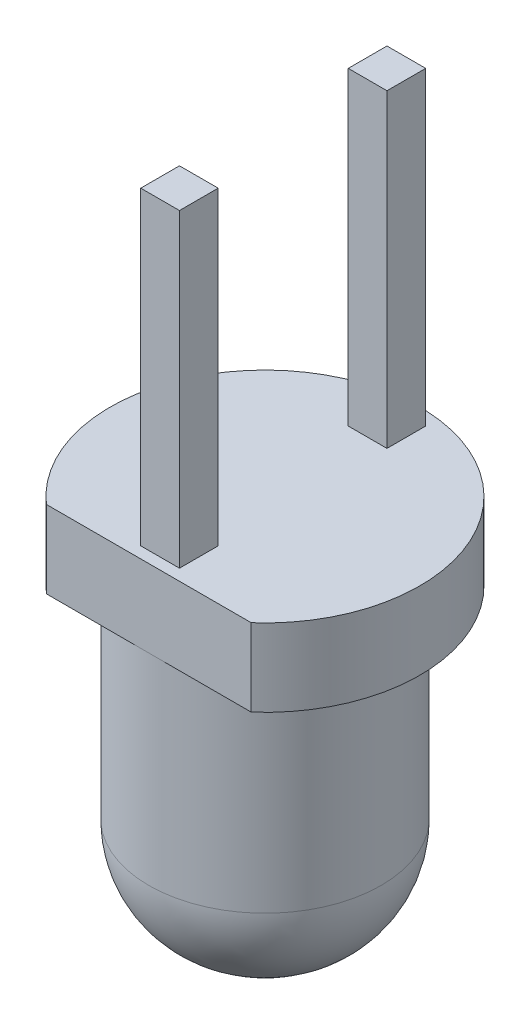
ISO-10303-21;
HEADER;
FILE_DESCRIPTION(('STEP AP214'),'2;1');
FILE_NAME('part.step','',(''),(''),'','','');
FILE_SCHEMA(('AUTOMOTIVE_DESIGN { 1 0 10303 214 1 1 1 1 }'));
ENDSEC;
DATA;
#1=APPLICATION_CONTEXT('core data for automotive mechanical design processes');
#2=APPLICATION_PROTOCOL_DEFINITION('international standard','automotive_design',2000,#1);
#3=PRODUCT_CONTEXT('',#1,'mechanical');
#4=PRODUCT('Part','Part','',(#3));
#5=PRODUCT_RELATED_PRODUCT_CATEGORY('part','',(#4));
#6=PRODUCT_DEFINITION_FORMATION('','',#4);
#7=PRODUCT_DEFINITION_CONTEXT('part definition',#1,'design');
#8=PRODUCT_DEFINITION('design','',#6,#7);
#9=PRODUCT_DEFINITION_SHAPE('','',#8);
#10=(LENGTH_UNIT() NAMED_UNIT(*) SI_UNIT(.MILLI.,.METRE.));
#11=(NAMED_UNIT(*) PLANE_ANGLE_UNIT() SI_UNIT($,.RADIAN.));
#12=(NAMED_UNIT(*) SI_UNIT($,.STERADIAN.) SOLID_ANGLE_UNIT());
#13=UNCERTAINTY_MEASURE_WITH_UNIT(LENGTH_MEASURE(1.E-05),#10,'distance_accuracy_value','');
#14=(GEOMETRIC_REPRESENTATION_CONTEXT(3) GLOBAL_UNCERTAINTY_ASSIGNED_CONTEXT((#13)) GLOBAL_UNIT_ASSIGNED_CONTEXT((#10,
#11,#12)) REPRESENTATION_CONTEXT('',''));
#15=CARTESIAN_POINT('',(0.,0.,0.));
#16=DIRECTION('',(0.,0.,1.));
#17=DIRECTION('',(1.,0.,0.));
#18=AXIS2_PLACEMENT_3D('',#15,#16,#17);
#19=CARTESIAN_POINT('',(0.,1.,0.));
#20=DIRECTION('',(0.,1.,0.));
#21=DIRECTION('',(0.,0.,1.));
#22=AXIS2_PLACEMENT_3D('',#19,#20,#21);
#23=PLANE('',#22);
#24=DIRECTION('',(1.,0.,0.));
#25=VECTOR('',#24,1.);
#26=CARTESIAN_POINT('',(-0.25,1.,1.35392403324586));
#27=LINE('',#26,#25);
#28=CARTESIAN_POINT('',(-0.25,1.,1.35392403324586));
#29=VERTEX_POINT('',#28);
#30=CARTESIAN_POINT('',(0.25,1.,1.35392403324586));
#31=VERTEX_POINT('',#30);
#32=EDGE_CURVE('E145',#29,#31,#27,.T.);
#33=ORIENTED_EDGE('',*,*,#32,.F.);
#34=DIRECTION('',(0.,0.,1.));
#35=VECTOR('',#34,1.);
#36=CARTESIAN_POINT('',(-0.25,1.,0.853924033245863));
#37=LINE('',#36,#35);
#38=CARTESIAN_POINT('',(-0.25,1.,0.853924033245863));
#39=VERTEX_POINT('',#38);
#40=EDGE_CURVE('E142',#39,#29,#37,.T.);
#41=ORIENTED_EDGE('',*,*,#40,.F.);
#42=DIRECTION('',(-1.,0.,0.));
#43=VECTOR('',#42,1.);
#44=CARTESIAN_POINT('',(-0.25,1.,0.853924033245863));
#45=LINE('',#44,#43);
#46=CARTESIAN_POINT('',(0.25,1.,0.853924033245863));
#47=VERTEX_POINT('',#46);
#48=EDGE_CURVE('E154',#47,#39,#45,.T.);
#49=ORIENTED_EDGE('',*,*,#48,.F.);
#50=DIRECTION('',(0.,0.,-1.));
#51=VECTOR('',#50,1.);
#52=CARTESIAN_POINT('',(0.25,1.,0.853924033245863));
#53=LINE('',#52,#51);
#54=EDGE_CURVE('E162',#31,#47,#53,.T.);
#55=ORIENTED_EDGE('',*,*,#54,.F.);
#56=EDGE_LOOP('',(#33,#41,#49,#55));
#57=FACE_BOUND('',#56,.T.);
#58=DIRECTION('',(-1.,0.,0.));
#59=VECTOR('',#58,1.);
#60=CARTESIAN_POINT('',(0.,1.,1.5));
#61=LINE('',#60,#59);
#62=CARTESIAN_POINT('',(1.3228756555323,1.,1.5));
#63=VERTEX_POINT('',#62);
#64=CARTESIAN_POINT('',(-1.3228756555323,1.,1.5));
#65=VERTEX_POINT('',#64);
#66=EDGE_CURVE('E11',#63,#65,#61,.T.);
#67=ORIENTED_EDGE('',*,*,#66,.F.);
#68=CARTESIAN_POINT('',(0.,1.,0.));
#69=DIRECTION('',(0.,1.,0.));
#70=DIRECTION('',(0.,0.,1.));
#71=AXIS2_PLACEMENT_3D('',#68,#69,#70);
#72=CIRCLE('',#71,2.);
#73=EDGE_CURVE('E182',#63,#65,#72,.T.);
#74=ORIENTED_EDGE('',*,*,#73,.T.);
#75=EDGE_LOOP('',(#67,#74));
#76=FACE_BOUND('',#75,.T.);
#77=DIRECTION('',(1.,0.,0.));
#78=VECTOR('',#77,1.);
#79=CARTESIAN_POINT('',(-0.25,1.,-1.32549518215412));
#80=LINE('',#79,#78);
#81=CARTESIAN_POINT('',(-0.25,1.,-1.32549518215412));
#82=VERTEX_POINT('',#81);
#83=CARTESIAN_POINT('',(0.25,1.,-1.32549518215412));
#84=VERTEX_POINT('',#83);
#85=EDGE_CURVE('E377',#82,#84,#80,.T.);
#86=ORIENTED_EDGE('',*,*,#85,.F.);
#87=DIRECTION('',(0.,0.,1.));
#88=VECTOR('',#87,1.);
#89=CARTESIAN_POINT('',(-0.25,1.,-1.82549518215412));
#90=LINE('',#89,#88);
#91=CARTESIAN_POINT('',(-0.25,1.,-1.82549518215412));
#92=VERTEX_POINT('',#91);
#93=EDGE_CURVE('E140',#92,#82,#90,.T.);
#94=ORIENTED_EDGE('',*,*,#93,.F.);
#95=DIRECTION('',(-1.,0.,0.));
#96=VECTOR('',#95,1.);
#97=CARTESIAN_POINT('',(-0.25,1.,-1.82549518215412));
#98=LINE('',#97,#96);
#99=CARTESIAN_POINT('',(0.25,1.,-1.82549518215412));
#100=VERTEX_POINT('',#99);
#101=EDGE_CURVE('E136',#100,#92,#98,.T.);
#102=ORIENTED_EDGE('',*,*,#101,.F.);
#103=DIRECTION('',(0.,0.,-1.));
#104=VECTOR('',#103,1.);
#105=CARTESIAN_POINT('',(0.25,1.,-1.82549518215412));
#106=LINE('',#105,#104);
#107=EDGE_CURVE('E374',#84,#100,#106,.T.);
#108=ORIENTED_EDGE('',*,*,#107,.F.);
#109=EDGE_LOOP('',(#86,#94,#102,#108));
#110=FACE_BOUND('',#109,.T.);
#111=ADVANCED_FACE('F37',(#57,#76,#110),#23,.T.);
#112=CARTESIAN_POINT('',(0.,0.,0.));
#113=DIRECTION('',(0.,1.,0.));
#114=DIRECTION('',(0.,0.,1.));
#115=AXIS2_PLACEMENT_3D('',#112,#113,#114);
#116=PLANE('',#115);
#117=CARTESIAN_POINT('',(0.,0.,0.));
#118=DIRECTION('',(0.,1.,0.));
#119=DIRECTION('',(0.,0.,1.));
#120=AXIS2_PLACEMENT_3D('',#117,#118,#119);
#121=CIRCLE('',#120,2.);
#122=CARTESIAN_POINT('',(1.3228756555323,0.,1.5));
#123=VERTEX_POINT('',#122);
#124=CARTESIAN_POINT('',(-1.3228756555323,0.,1.5));
#125=VERTEX_POINT('',#124);
#126=EDGE_CURVE('E180',#123,#125,#121,.T.);
#127=ORIENTED_EDGE('',*,*,#126,.F.);
#128=DIRECTION('',(1.,0.,0.));
#129=VECTOR('',#128,1.);
#130=CARTESIAN_POINT('',(-1.3228756555323,0.,1.5));
#131=LINE('',#130,#129);
#132=CARTESIAN_POINT('',(0.,0.,1.5));
#133=VERTEX_POINT('',#132);
#134=EDGE_CURVE('E173',#133,#123,#131,.T.);
#135=ORIENTED_EDGE('',*,*,#134,.F.);
#136=CARTESIAN_POINT('',(0.,0.,0.));
#137=DIRECTION('',(0.,1.,0.));
#138=DIRECTION('',(0.,0.,1.));
#139=AXIS2_PLACEMENT_3D('',#136,#137,#138);
#140=CIRCLE('',#139,1.5);
#141=EDGE_CURVE('E185',#133,#133,#140,.F.);
#142=ORIENTED_EDGE('',*,*,#141,.F.);
#143=EDGE_CURVE('E174',#125,#133,#131,.T.);
#144=ORIENTED_EDGE('',*,*,#143,.F.);
#145=EDGE_LOOP('',(#127,#135,#142,#144));
#146=FACE_BOUND('',#145,.T.);
#147=ADVANCED_FACE('F213',(#146),#116,.F.);
#148=CARTESIAN_POINT('',(0.,1.,0.));
#149=DIRECTION('',(0.,-1.,0.));
#150=DIRECTION('',(0.,0.,-1.));
#151=AXIS2_PLACEMENT_3D('',#148,#149,#150);
#152=CYLINDRICAL_SURFACE('',#151,2.);
#153=ORIENTED_EDGE('',*,*,#73,.F.);
#154=DIRECTION('',(0.,-1.,0.));
#155=VECTOR('',#154,1.);
#156=CARTESIAN_POINT('',(1.3228756555323,4.,1.5));
#157=LINE('',#156,#155);
#158=EDGE_CURVE('E177',#63,#123,#157,.T.);
#159=ORIENTED_EDGE('',*,*,#158,.T.);
#160=ORIENTED_EDGE('',*,*,#126,.T.);
#161=DIRECTION('',(0.,-1.,0.));
#162=VECTOR('',#161,1.);
#163=CARTESIAN_POINT('',(-1.3228756555323,4.,1.5));
#164=LINE('',#163,#162);
#165=EDGE_CURVE('E176',#65,#125,#164,.T.);
#166=ORIENTED_EDGE('',*,*,#165,.F.);
#167=EDGE_LOOP('',(#153,#159,#160,#166));
#168=FACE_BOUND('',#167,.T.);
#169=ADVANCED_FACE('F209',(#168),#152,.T.);
#170=CARTESIAN_POINT('',(0.,-4.,0.));
#171=DIRECTION('',(0.,1.,0.));
#172=DIRECTION('',(0.,0.,1.));
#173=AXIS2_PLACEMENT_3D('',#170,#171,#172);
#174=CYLINDRICAL_SURFACE('',#173,1.5);
#175=CARTESIAN_POINT('',(0.,-2.6,0.));
#176=DIRECTION('',(0.,-1.,0.));
#177=DIRECTION('',(0.,0.,-1.));
#178=AXIS2_PLACEMENT_3D('',#175,#176,#177);
#179=CIRCLE('',#178,1.5);
#180=CARTESIAN_POINT('',(0.,-2.6,-1.5));
#181=VERTEX_POINT('',#180);
#182=EDGE_CURVE('E45',#181,#181,#179,.F.);
#183=ORIENTED_EDGE('',*,*,#182,.T.);
#184=EDGE_LOOP('',(#183));
#185=FACE_BOUND('',#184,.T.);
#186=ORIENTED_EDGE('',*,*,#141,.T.);
#187=EDGE_LOOP('',(#186));
#188=FACE_BOUND('',#187,.T.);
#189=ADVANCED_FACE('F195',(#185,#188),#174,.T.);
#190=CARTESIAN_POINT('',(0.,-4.,0.));
#191=DIRECTION('',(0.,-1.,0.));
#192=DIRECTION('',(0.,0.,-1.));
#193=AXIS2_PLACEMENT_3D('',#190,#191,#192);
#194=PLANE('',#193);
#195=CARTESIAN_POINT('',(0.,-4.,0.));
#196=DIRECTION('',(0.,-1.,0.));
#197=DIRECTION('',(0.,0.,-1.));
#198=AXIS2_PLACEMENT_3D('',#195,#196,#197);
#199=CIRCLE('',#198,0.1);
#200=CARTESIAN_POINT('',(0.,-4.,-0.1));
#201=VERTEX_POINT('',#200);
#202=EDGE_CURVE('E190',#201,#201,#199,.T.);
#203=ORIENTED_EDGE('',*,*,#202,.T.);
#204=EDGE_LOOP('',(#203));
#205=FACE_BOUND('',#204,.T.);
#206=ADVANCED_FACE('F201',(#205),#194,.T.);
#207=CARTESIAN_POINT('',(0.,-2.6,0.));
#208=DIRECTION('',(0.,-1.,0.));
#209=DIRECTION('',(0.,0.,-1.));
#210=AXIS2_PLACEMENT_3D('',#207,#208,#209);
#211=DEGENERATE_TOROIDAL_SURFACE('',#210,0.1,1.4,.T.);
#212=ORIENTED_EDGE('',*,*,#182,.F.);
#213=EDGE_LOOP('',(#212));
#214=FACE_BOUND('',#213,.T.);
#215=ORIENTED_EDGE('',*,*,#202,.F.);
#216=EDGE_LOOP('',(#215));
#217=FACE_BOUND('',#216,.T.);
#218=ADVANCED_FACE('F39',(#214,#217),#211,.T.);
#219=CARTESIAN_POINT('',(-1.3228756555323,4.,1.5));
#220=DIRECTION('',(0.,0.,-1.));
#221=DIRECTION('',(-1.,0.,0.));
#222=AXIS2_PLACEMENT_3D('',#219,#220,#221);
#223=PLANE('',#222);
#224=ORIENTED_EDGE('',*,*,#66,.T.);
#225=ORIENTED_EDGE('',*,*,#165,.T.);
#226=ORIENTED_EDGE('',*,*,#143,.T.);
#227=ORIENTED_EDGE('',*,*,#134,.T.);
#228=ORIENTED_EDGE('',*,*,#158,.F.);
#229=EDGE_LOOP('',(#224,#225,#226,#227,#228));
#230=FACE_BOUND('',#229,.T.);
#231=ADVANCED_FACE('F200',(#230),#223,.F.);
#232=CARTESIAN_POINT('',(-0.25,5.,0.853924033245863));
#233=DIRECTION('',(1.,0.,0.));
#234=DIRECTION('',(0.,0.,-1.));
#235=AXIS2_PLACEMENT_3D('',#232,#233,#234);
#236=PLANE('',#235);
#237=ORIENTED_EDGE('',*,*,#40,.T.);
#238=DIRECTION('',(0.,-1.,0.));
#239=VECTOR('',#238,1.);
#240=CARTESIAN_POINT('',(-0.25,5.,1.35392403324586));
#241=LINE('',#240,#239);
#242=CARTESIAN_POINT('',(-0.25,5.,1.35392403324586));
#243=VERTEX_POINT('',#242);
#244=EDGE_CURVE('E171',#243,#29,#241,.T.);
#245=ORIENTED_EDGE('',*,*,#244,.F.);
#246=DIRECTION('',(0.,0.,1.));
#247=VECTOR('',#246,1.);
#248=CARTESIAN_POINT('',(-0.25,5.,0.853924033245863));
#249=LINE('',#248,#247);
#250=CARTESIAN_POINT('',(-0.25,5.,0.853924033245863));
#251=VERTEX_POINT('',#250);
#252=EDGE_CURVE('E150',#251,#243,#249,.T.);
#253=ORIENTED_EDGE('',*,*,#252,.F.);
#254=DIRECTION('',(0.,-1.,0.));
#255=VECTOR('',#254,1.);
#256=CARTESIAN_POINT('',(-0.25,5.,0.853924033245863));
#257=LINE('',#256,#255);
#258=EDGE_CURVE('E159',#251,#39,#257,.T.);
#259=ORIENTED_EDGE('',*,*,#258,.T.);
#260=EDGE_LOOP('',(#237,#245,#253,#259));
#261=FACE_BOUND('',#260,.T.);
#262=ADVANCED_FACE('F237',(#261),#236,.F.);
#263=CARTESIAN_POINT('',(-0.25,5.,1.35392403324586));
#264=DIRECTION('',(0.,0.,-1.));
#265=DIRECTION('',(-1.,0.,0.));
#266=AXIS2_PLACEMENT_3D('',#263,#264,#265);
#267=PLANE('',#266);
#268=ORIENTED_EDGE('',*,*,#32,.T.);
#269=DIRECTION('',(0.,-1.,0.));
#270=VECTOR('',#269,1.);
#271=CARTESIAN_POINT('',(0.25,5.,1.35392403324586));
#272=LINE('',#271,#270);
#273=CARTESIAN_POINT('',(0.25,5.,1.35392403324586));
#274=VERTEX_POINT('',#273);
#275=EDGE_CURVE('E168',#274,#31,#272,.T.);
#276=ORIENTED_EDGE('',*,*,#275,.F.);
#277=DIRECTION('',(1.,0.,0.));
#278=VECTOR('',#277,1.);
#279=CARTESIAN_POINT('',(-0.25,5.,1.35392403324586));
#280=LINE('',#279,#278);
#281=EDGE_CURVE('E153',#243,#274,#280,.T.);
#282=ORIENTED_EDGE('',*,*,#281,.F.);
#283=ORIENTED_EDGE('',*,*,#244,.T.);
#284=EDGE_LOOP('',(#268,#276,#282,#283));
#285=FACE_BOUND('',#284,.T.);
#286=ADVANCED_FACE('F241',(#285),#267,.F.);
#287=CARTESIAN_POINT('',(0.25,5.,0.853924033245863));
#288=DIRECTION('',(-1.,0.,0.));
#289=DIRECTION('',(0.,0.,1.));
#290=AXIS2_PLACEMENT_3D('',#287,#288,#289);
#291=PLANE('',#290);
#292=ORIENTED_EDGE('',*,*,#54,.T.);
#293=DIRECTION('',(0.,-1.,0.));
#294=VECTOR('',#293,1.);
#295=CARTESIAN_POINT('',(0.25,5.,0.853924033245863));
#296=LINE('',#295,#294);
#297=CARTESIAN_POINT('',(0.25,5.,0.853924033245863));
#298=VERTEX_POINT('',#297);
#299=EDGE_CURVE('E60',#298,#47,#296,.T.);
#300=ORIENTED_EDGE('',*,*,#299,.F.);
#301=DIRECTION('',(0.,0.,-1.));
#302=VECTOR('',#301,1.);
#303=CARTESIAN_POINT('',(0.25,5.,0.853924033245863));
#304=LINE('',#303,#302);
#305=EDGE_CURVE('E156',#274,#298,#304,.T.);
#306=ORIENTED_EDGE('',*,*,#305,.F.);
#307=ORIENTED_EDGE('',*,*,#275,.T.);
#308=EDGE_LOOP('',(#292,#300,#306,#307));
#309=FACE_BOUND('',#308,.T.);
#310=ADVANCED_FACE('F247',(#309),#291,.F.);
#311=CARTESIAN_POINT('',(-0.25,5.,0.853924033245863));
#312=DIRECTION('',(0.,0.,1.));
#313=DIRECTION('',(1.,0.,0.));
#314=AXIS2_PLACEMENT_3D('',#311,#312,#313);
#315=PLANE('',#314);
#316=ORIENTED_EDGE('',*,*,#48,.T.);
#317=ORIENTED_EDGE('',*,*,#258,.F.);
#318=DIRECTION('',(-1.,0.,0.));
#319=VECTOR('',#318,1.);
#320=CARTESIAN_POINT('',(-0.25,5.,0.853924033245863));
#321=LINE('',#320,#319);
#322=EDGE_CURVE('E158',#298,#251,#321,.T.);
#323=ORIENTED_EDGE('',*,*,#322,.F.);
#324=ORIENTED_EDGE('',*,*,#299,.T.);
#325=EDGE_LOOP('',(#316,#317,#323,#324));
#326=FACE_BOUND('',#325,.T.);
#327=ADVANCED_FACE('F251',(#326),#315,.F.);
#328=CARTESIAN_POINT('',(0.,5.,0.));
#329=DIRECTION('',(0.,1.,0.));
#330=DIRECTION('',(0.,0.,1.));
#331=AXIS2_PLACEMENT_3D('',#328,#329,#330);
#332=PLANE('',#331);
#333=ORIENTED_EDGE('',*,*,#252,.T.);
#334=ORIENTED_EDGE('',*,*,#281,.T.);
#335=ORIENTED_EDGE('',*,*,#305,.T.);
#336=ORIENTED_EDGE('',*,*,#322,.T.);
#337=EDGE_LOOP('',(#333,#334,#335,#336));
#338=FACE_BOUND('',#337,.T.);
#339=ADVANCED_FACE('F255',(#338),#332,.T.);
#340=CARTESIAN_POINT('',(-0.25,5.,-1.82549518215412));
#341=DIRECTION('',(1.,0.,0.));
#342=DIRECTION('',(0.,0.,-1.));
#343=AXIS2_PLACEMENT_3D('',#340,#341,#342);
#344=PLANE('',#343);
#345=ORIENTED_EDGE('',*,*,#93,.T.);
#346=DIRECTION('',(0.,-1.,0.));
#347=VECTOR('',#346,1.);
#348=CARTESIAN_POINT('',(-0.25,5.,-1.32549518215412));
#349=LINE('',#348,#347);
#350=CARTESIAN_POINT('',(-0.25,5.,-1.32549518215412));
#351=VERTEX_POINT('',#350);
#352=EDGE_CURVE('E121',#351,#82,#349,.T.);
#353=ORIENTED_EDGE('',*,*,#352,.F.);
#354=DIRECTION('',(0.,0.,1.));
#355=VECTOR('',#354,1.);
#356=CARTESIAN_POINT('',(-0.25,5.,-1.82549518215412));
#357=LINE('',#356,#355);
#358=CARTESIAN_POINT('',(-0.25,5.,-1.82549518215412));
#359=VERTEX_POINT('',#358);
#360=EDGE_CURVE('E128',#359,#351,#357,.T.);
#361=ORIENTED_EDGE('',*,*,#360,.F.);
#362=DIRECTION('',(0.,-1.,0.));
#363=VECTOR('',#362,1.);
#364=CARTESIAN_POINT('',(-0.25,5.,-1.82549518215412));
#365=LINE('',#364,#363);
#366=EDGE_CURVE('E372',#359,#92,#365,.T.);
#367=ORIENTED_EDGE('',*,*,#366,.T.);
#368=EDGE_LOOP('',(#345,#353,#361,#367));
#369=FACE_BOUND('',#368,.T.);
#370=ADVANCED_FACE('F138',(#369),#344,.F.);
#371=CARTESIAN_POINT('',(-0.25,5.,-1.32549518215412));
#372=DIRECTION('',(0.,0.,-1.));
#373=DIRECTION('',(-1.,0.,0.));
#374=AXIS2_PLACEMENT_3D('',#371,#372,#373);
#375=PLANE('',#374);
#376=ORIENTED_EDGE('',*,*,#85,.T.);
#377=DIRECTION('',(0.,-1.,0.));
#378=VECTOR('',#377,1.);
#379=CARTESIAN_POINT('',(0.25,5.,-1.32549518215412));
#380=LINE('',#379,#378);
#381=CARTESIAN_POINT('',(0.25,5.,-1.32549518215412));
#382=VERTEX_POINT('',#381);
#383=EDGE_CURVE('E124',#382,#84,#380,.T.);
#384=ORIENTED_EDGE('',*,*,#383,.F.);
#385=DIRECTION('',(1.,0.,0.));
#386=VECTOR('',#385,1.);
#387=CARTESIAN_POINT('',(-0.25,5.,-1.32549518215412));
#388=LINE('',#387,#386);
#389=EDGE_CURVE('E117',#351,#382,#388,.T.);
#390=ORIENTED_EDGE('',*,*,#389,.F.);
#391=ORIENTED_EDGE('',*,*,#352,.T.);
#392=EDGE_LOOP('',(#376,#384,#390,#391));
#393=FACE_BOUND('',#392,.T.);
#394=ADVANCED_FACE('F119',(#393),#375,.F.);
#395=CARTESIAN_POINT('',(0.25,5.,-1.82549518215412));
#396=DIRECTION('',(-1.,0.,0.));
#397=DIRECTION('',(0.,0.,1.));
#398=AXIS2_PLACEMENT_3D('',#395,#396,#397);
#399=PLANE('',#398);
#400=ORIENTED_EDGE('',*,*,#107,.T.);
#401=DIRECTION('',(0.,-1.,0.));
#402=VECTOR('',#401,1.);
#403=CARTESIAN_POINT('',(0.25,5.,-1.82549518215412));
#404=LINE('',#403,#402);
#405=CARTESIAN_POINT('',(0.25,5.,-1.82549518215412));
#406=VERTEX_POINT('',#405);
#407=EDGE_CURVE('E52',#406,#100,#404,.T.);
#408=ORIENTED_EDGE('',*,*,#407,.F.);
#409=DIRECTION('',(0.,0.,-1.));
#410=VECTOR('',#409,1.);
#411=CARTESIAN_POINT('',(0.25,5.,-1.82549518215412));
#412=LINE('',#411,#410);
#413=EDGE_CURVE('E127',#382,#406,#412,.T.);
#414=ORIENTED_EDGE('',*,*,#413,.F.);
#415=ORIENTED_EDGE('',*,*,#383,.T.);
#416=EDGE_LOOP('',(#400,#408,#414,#415));
#417=FACE_BOUND('',#416,.T.);
#418=ADVANCED_FACE('F263',(#417),#399,.F.);
#419=CARTESIAN_POINT('',(-0.25,5.,-1.82549518215412));
#420=DIRECTION('',(0.,0.,1.));
#421=DIRECTION('',(1.,0.,0.));
#422=AXIS2_PLACEMENT_3D('',#419,#420,#421);
#423=PLANE('',#422);
#424=ORIENTED_EDGE('',*,*,#101,.T.);
#425=ORIENTED_EDGE('',*,*,#366,.F.);
#426=DIRECTION('',(-1.,0.,0.));
#427=VECTOR('',#426,1.);
#428=CARTESIAN_POINT('',(-0.25,5.,-1.82549518215412));
#429=LINE('',#428,#427);
#430=EDGE_CURVE('E132',#406,#359,#429,.T.);
#431=ORIENTED_EDGE('',*,*,#430,.F.);
#432=ORIENTED_EDGE('',*,*,#407,.T.);
#433=EDGE_LOOP('',(#424,#425,#431,#432));
#434=FACE_BOUND('',#433,.T.);
#435=ADVANCED_FACE('F266',(#434),#423,.F.);
#436=CARTESIAN_POINT('',(0.,5.,0.));
#437=DIRECTION('',(0.,1.,0.));
#438=DIRECTION('',(0.,0.,1.));
#439=AXIS2_PLACEMENT_3D('',#436,#437,#438);
#440=PLANE('',#439);
#441=ORIENTED_EDGE('',*,*,#360,.T.);
#442=ORIENTED_EDGE('',*,*,#389,.T.);
#443=ORIENTED_EDGE('',*,*,#413,.T.);
#444=ORIENTED_EDGE('',*,*,#430,.T.);
#445=EDGE_LOOP('',(#441,#442,#443,#444));
#446=FACE_BOUND('',#445,.T.);
#447=ADVANCED_FACE('F131',(#446),#440,.T.);
#448=CLOSED_SHELL('',(#111,#147,#169,#189,#206,#218,#231,#262,#286,#310,#327,#339,#370,#394,
#418,#435,#447));
#449=MANIFOLD_SOLID_BREP('B2',#448);
#450=ADVANCED_BREP_SHAPE_REPRESENTATION('',(#18,#449),#14);
#451=SHAPE_DEFINITION_REPRESENTATION(#9,#450);
ENDSEC;
END-ISO-10303-21;
